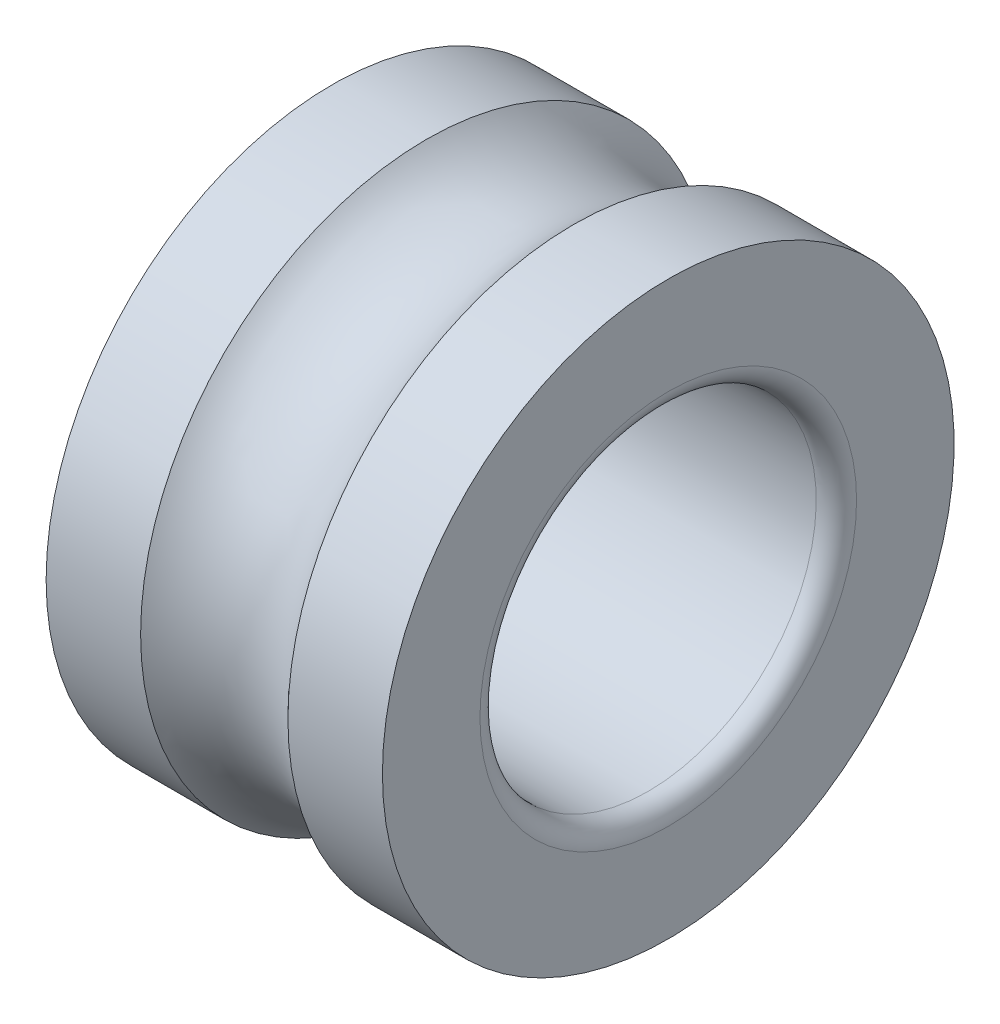
ISO-10303-21;
HEADER;
FILE_DESCRIPTION(('STEP AP214'),'2;1');
FILE_NAME('part.step','',(''),(''),'','','');
FILE_SCHEMA(('AUTOMOTIVE_DESIGN { 1 0 10303 214 1 1 1 1 }'));
ENDSEC;
DATA;
#1=APPLICATION_CONTEXT('core data for automotive mechanical design processes');
#2=APPLICATION_PROTOCOL_DEFINITION('international standard','automotive_design',2000,#1);
#3=PRODUCT_CONTEXT('',#1,'mechanical');
#4=PRODUCT('Part','Part','',(#3));
#5=PRODUCT_RELATED_PRODUCT_CATEGORY('part','',(#4));
#6=PRODUCT_DEFINITION_FORMATION('','',#4);
#7=PRODUCT_DEFINITION_CONTEXT('part definition',#1,'design');
#8=PRODUCT_DEFINITION('design','',#6,#7);
#9=PRODUCT_DEFINITION_SHAPE('','',#8);
#10=(LENGTH_UNIT() NAMED_UNIT(*) SI_UNIT(.MILLI.,.METRE.));
#11=(NAMED_UNIT(*) PLANE_ANGLE_UNIT() SI_UNIT($,.RADIAN.));
#12=(NAMED_UNIT(*) SI_UNIT($,.STERADIAN.) SOLID_ANGLE_UNIT());
#13=UNCERTAINTY_MEASURE_WITH_UNIT(LENGTH_MEASURE(1.E-05),#10,'distance_accuracy_value','');
#14=(GEOMETRIC_REPRESENTATION_CONTEXT(3) GLOBAL_UNCERTAINTY_ASSIGNED_CONTEXT((#13)) GLOBAL_UNIT_ASSIGNED_CONTEXT((#10,
#11,#12)) REPRESENTATION_CONTEXT('',''));
#15=CARTESIAN_POINT('',(0.,0.,0.));
#16=DIRECTION('',(0.,0.,1.));
#17=DIRECTION('',(1.,0.,0.));
#18=AXIS2_PLACEMENT_3D('',#15,#16,#17);
#19=CARTESIAN_POINT('',(4.7,0.,0.));
#20=DIRECTION('',(-1.,0.,0.));
#21=DIRECTION('',(0.,0.,1.));
#22=AXIS2_PLACEMENT_3D('',#19,#20,#21);
#23=CYLINDRICAL_SURFACE('',#22,2.5);
#24=CARTESIAN_POINT('',(4.7,0.,0.));
#25=DIRECTION('',(-1.,0.,0.));
#26=DIRECTION('',(0.,-1.,0.));
#27=AXIS2_PLACEMENT_3D('',#24,#25,#26);
#28=CIRCLE('',#27,2.5);
#29=CARTESIAN_POINT('',(4.7,-2.5,0.));
#30=VERTEX_POINT('',#29);
#31=EDGE_CURVE('E67',#30,#30,#28,.T.);
#32=ORIENTED_EDGE('',*,*,#31,.F.);
#33=EDGE_LOOP('',(#32));
#34=FACE_BOUND('',#33,.T.);
#35=CARTESIAN_POINT('',(0.3,0.,0.));
#36=DIRECTION('',(-1.,0.,0.));
#37=DIRECTION('',(0.,-1.,0.));
#38=AXIS2_PLACEMENT_3D('',#35,#36,#37);
#39=CIRCLE('',#38,2.5);
#40=CARTESIAN_POINT('',(0.3,-2.5,0.));
#41=VERTEX_POINT('',#40);
#42=EDGE_CURVE('E70',#41,#41,#39,.F.);
#43=ORIENTED_EDGE('',*,*,#42,.F.);
#44=EDGE_LOOP('',(#43));
#45=FACE_BOUND('',#44,.T.);
#46=ADVANCED_FACE('F13',(#34,#45),#23,.F.);
#47=CARTESIAN_POINT('',(0.299999999999999,0.,0.));
#48=DIRECTION('',(-1.,0.,0.));
#49=DIRECTION('',(0.,-1.,0.));
#50=AXIS2_PLACEMENT_3D('',#47,#48,#49);
#51=TOROIDAL_SURFACE('',#50,2.8,0.299999999999999);
#52=CARTESIAN_POINT('',(0.,0.,0.));
#53=DIRECTION('',(-1.,0.,0.));
#54=DIRECTION('',(0.,0.,1.));
#55=AXIS2_PLACEMENT_3D('',#52,#53,#54);
#56=CIRCLE('',#55,2.8);
#57=CARTESIAN_POINT('',(0.,0.,2.8));
#58=VERTEX_POINT('',#57);
#59=EDGE_CURVE('E37',#58,#58,#56,.F.);
#60=ORIENTED_EDGE('',*,*,#59,.F.);
#61=EDGE_LOOP('',(#60));
#62=FACE_BOUND('',#61,.T.);
#63=ORIENTED_EDGE('',*,*,#42,.T.);
#64=EDGE_LOOP('',(#63));
#65=FACE_BOUND('',#64,.T.);
#66=ADVANCED_FACE('F59',(#62,#65),#51,.T.);
#67=CARTESIAN_POINT('',(4.7,0.,0.));
#68=DIRECTION('',(-1.,0.,0.));
#69=DIRECTION('',(0.,-1.,0.));
#70=AXIS2_PLACEMENT_3D('',#67,#68,#69);
#71=TOROIDAL_SURFACE('',#70,2.8,0.3);
#72=ORIENTED_EDGE('',*,*,#31,.T.);
#73=EDGE_LOOP('',(#72));
#74=FACE_BOUND('',#73,.T.);
#75=CARTESIAN_POINT('',(5.,0.,0.));
#76=DIRECTION('',(1.,0.,0.));
#77=DIRECTION('',(0.,0.,1.));
#78=AXIS2_PLACEMENT_3D('',#75,#76,#77);
#79=CIRCLE('',#78,2.8);
#80=CARTESIAN_POINT('',(5.,0.,2.8));
#81=VERTEX_POINT('',#80);
#82=EDGE_CURVE('E74',#81,#81,#79,.F.);
#83=ORIENTED_EDGE('',*,*,#82,.F.);
#84=EDGE_LOOP('',(#83));
#85=FACE_BOUND('',#84,.T.);
#86=ADVANCED_FACE('F52',(#74,#85),#71,.T.);
#87=CARTESIAN_POINT('',(0.,0.,3.525));
#88=DIRECTION('',(-1.,0.,0.));
#89=DIRECTION('',(0.,0.,1.));
#90=AXIS2_PLACEMENT_3D('',#87,#88,#89);
#91=PLANE('',#90);
#92=CARTESIAN_POINT('',(0.,0.,0.));
#93=DIRECTION('',(-1.,0.,0.));
#94=DIRECTION('',(0.,0.,1.));
#95=AXIS2_PLACEMENT_3D('',#92,#93,#94);
#96=CIRCLE('',#95,4.25);
#97=CARTESIAN_POINT('',(0.,0.,4.25));
#98=VERTEX_POINT('',#97);
#99=EDGE_CURVE('E16',#98,#98,#96,.F.);
#100=ORIENTED_EDGE('',*,*,#99,.F.);
#101=EDGE_LOOP('',(#100));
#102=FACE_BOUND('',#101,.T.);
#103=ORIENTED_EDGE('',*,*,#59,.T.);
#104=EDGE_LOOP('',(#103));
#105=FACE_BOUND('',#104,.T.);
#106=ADVANCED_FACE('F42',(#102,#105),#91,.T.);
#107=CARTESIAN_POINT('',(5.,0.,3.525));
#108=DIRECTION('',(1.,0.,0.));
#109=DIRECTION('',(0.,0.,-1.));
#110=AXIS2_PLACEMENT_3D('',#107,#108,#109);
#111=PLANE('',#110);
#112=ORIENTED_EDGE('',*,*,#82,.T.);
#113=EDGE_LOOP('',(#112));
#114=FACE_BOUND('',#113,.T.);
#115=CARTESIAN_POINT('',(5.,0.,0.));
#116=DIRECTION('',(-1.,0.,0.));
#117=DIRECTION('',(0.,0.,1.));
#118=AXIS2_PLACEMENT_3D('',#115,#116,#117);
#119=CIRCLE('',#118,4.25);
#120=CARTESIAN_POINT('',(5.,0.,4.25));
#121=VERTEX_POINT('',#120);
#122=EDGE_CURVE('E25',#121,#121,#119,.T.);
#123=ORIENTED_EDGE('',*,*,#122,.F.);
#124=EDGE_LOOP('',(#123));
#125=FACE_BOUND('',#124,.T.);
#126=ADVANCED_FACE('F51',(#114,#125),#111,.T.);
#127=CARTESIAN_POINT('',(0.702420097154762,0.,0.));
#128=DIRECTION('',(-1.,0.,0.));
#129=DIRECTION('',(0.,0.,1.));
#130=AXIS2_PLACEMENT_3D('',#127,#128,#129);
#131=CYLINDRICAL_SURFACE('',#130,4.25);
#132=ORIENTED_EDGE('',*,*,#99,.T.);
#133=EDGE_LOOP('',(#132));
#134=FACE_BOUND('',#133,.T.);
#135=CARTESIAN_POINT('',(1.40484019430952,0.,0.));
#136=DIRECTION('',(-1.,0.,0.));
#137=DIRECTION('',(0.,-1.,0.));
#138=AXIS2_PLACEMENT_3D('',#135,#136,#137);
#139=CIRCLE('',#138,4.25);
#140=CARTESIAN_POINT('',(1.40484019430952,-4.25,0.));
#141=VERTEX_POINT('',#140);
#142=EDGE_CURVE('E20',#141,#141,#139,.F.);
#143=ORIENTED_EDGE('',*,*,#142,.F.);
#144=EDGE_LOOP('',(#143));
#145=FACE_BOUND('',#144,.T.);
#146=ADVANCED_FACE('F111',(#134,#145),#131,.T.);
#147=CARTESIAN_POINT('',(4.29757990284524,0.,0.));
#148=DIRECTION('',(-1.,0.,0.));
#149=DIRECTION('',(0.,0.,1.));
#150=AXIS2_PLACEMENT_3D('',#147,#148,#149);
#151=CYLINDRICAL_SURFACE('',#150,4.25);
#152=CARTESIAN_POINT('',(3.59515980569047,0.,0.));
#153=DIRECTION('',(-1.,0.,0.));
#154=DIRECTION('',(0.,-1.,0.));
#155=AXIS2_PLACEMENT_3D('',#152,#153,#154);
#156=CIRCLE('',#155,4.25);
#157=CARTESIAN_POINT('',(3.59515980569047,-4.25,0.));
#158=VERTEX_POINT('',#157);
#159=EDGE_CURVE('E9',#158,#158,#156,.T.);
#160=ORIENTED_EDGE('',*,*,#159,.F.);
#161=EDGE_LOOP('',(#160));
#162=FACE_BOUND('',#161,.T.);
#163=ORIENTED_EDGE('',*,*,#122,.T.);
#164=EDGE_LOOP('',(#163));
#165=FACE_BOUND('',#164,.T.);
#166=ADVANCED_FACE('F109',(#162,#165),#151,.T.);
#167=CARTESIAN_POINT('',(2.5,0.,0.));
#168=DIRECTION('',(-1.,0.,0.));
#169=DIRECTION('',(0.,-1.,0.));
#170=AXIS2_PLACEMENT_3D('',#167,#168,#169);
#171=TOROIDAL_SURFACE('',#170,5.275,1.5);
#172=ORIENTED_EDGE('',*,*,#159,.T.);
#173=EDGE_LOOP('',(#172));
#174=FACE_BOUND('',#173,.T.);
#175=ORIENTED_EDGE('',*,*,#142,.T.);
#176=EDGE_LOOP('',(#175));
#177=FACE_BOUND('',#176,.T.);
#178=ADVANCED_FACE('F106',(#174,#177),#171,.F.);
#179=CLOSED_SHELL('',(#46,#66,#86,#106,#126,#146,#166,#178));
#180=MANIFOLD_SOLID_BREP('B1',#179);
#181=ADVANCED_BREP_SHAPE_REPRESENTATION('',(#18,#180),#14);
#182=SHAPE_DEFINITION_REPRESENTATION(#9,#181);
ENDSEC;
END-ISO-10303-21;
